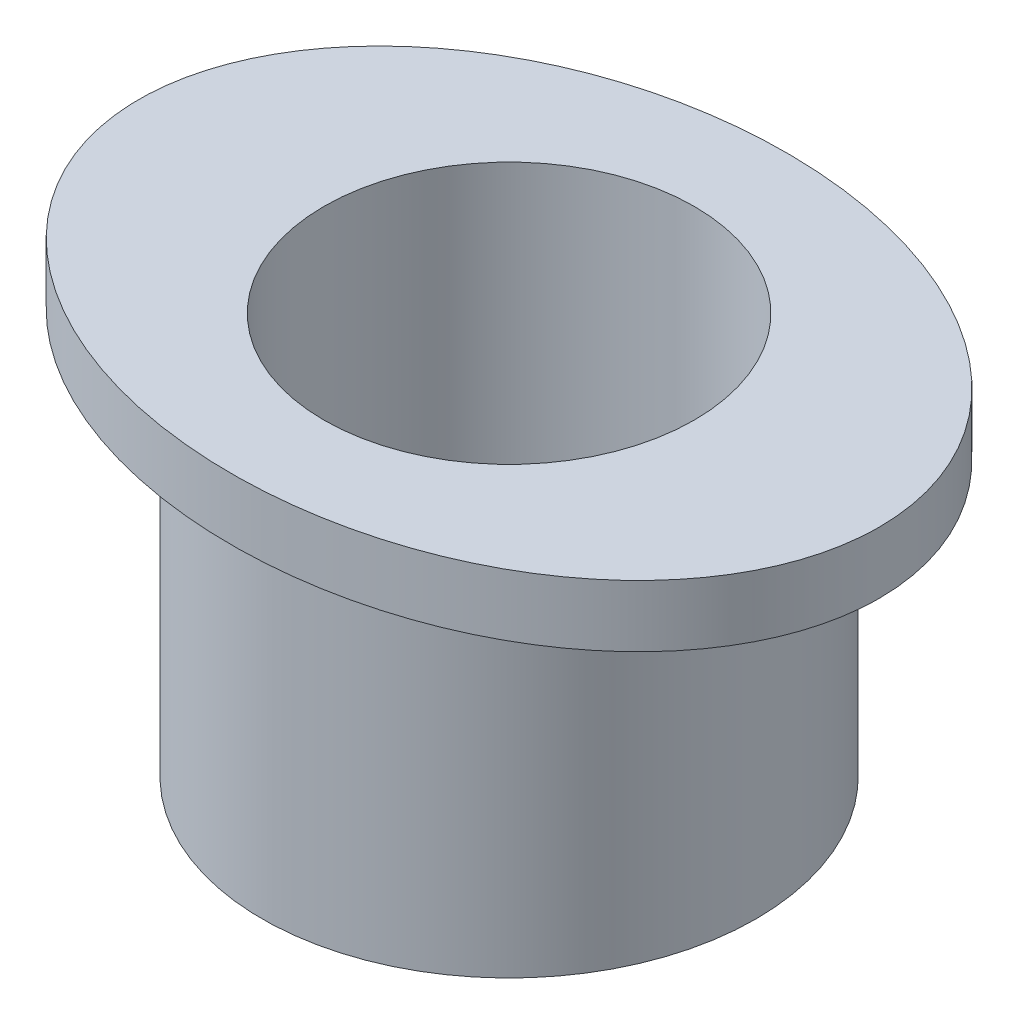
ISO-10303-21;
HEADER;
FILE_DESCRIPTION(('STEP AP214'),'2;1');
FILE_NAME('part.step','',(''),(''),'','','');
FILE_SCHEMA(('AUTOMOTIVE_DESIGN { 1 0 10303 214 1 1 1 1 }'));
ENDSEC;
DATA;
#1=APPLICATION_CONTEXT('core data for automotive mechanical design processes');
#2=APPLICATION_PROTOCOL_DEFINITION('international standard','automotive_design',2000,#1);
#3=PRODUCT_CONTEXT('',#1,'mechanical');
#4=PRODUCT('Part','Part','',(#3));
#5=PRODUCT_RELATED_PRODUCT_CATEGORY('part','',(#4));
#6=PRODUCT_DEFINITION_FORMATION('','',#4);
#7=PRODUCT_DEFINITION_CONTEXT('part definition',#1,'design');
#8=PRODUCT_DEFINITION('design','',#6,#7);
#9=PRODUCT_DEFINITION_SHAPE('','',#8);
#10=(LENGTH_UNIT() NAMED_UNIT(*) SI_UNIT(.MILLI.,.METRE.));
#11=(NAMED_UNIT(*) PLANE_ANGLE_UNIT() SI_UNIT($,.RADIAN.));
#12=(NAMED_UNIT(*) SI_UNIT($,.STERADIAN.) SOLID_ANGLE_UNIT());
#13=UNCERTAINTY_MEASURE_WITH_UNIT(LENGTH_MEASURE(1.E-05),#10,'distance_accuracy_value','');
#14=(GEOMETRIC_REPRESENTATION_CONTEXT(3) GLOBAL_UNCERTAINTY_ASSIGNED_CONTEXT((#13)) GLOBAL_UNIT_ASSIGNED_CONTEXT((#10,
#11,#12)) REPRESENTATION_CONTEXT('',''));
#15=CARTESIAN_POINT('',(0.,0.,0.));
#16=DIRECTION('',(0.,0.,1.));
#17=DIRECTION('',(1.,0.,0.));
#18=AXIS2_PLACEMENT_3D('',#15,#16,#17);
#19=CARTESIAN_POINT('',(0.,-5.5,0.));
#20=DIRECTION('',(0.,1.,0.));
#21=DIRECTION('',(0.,0.,1.));
#22=AXIS2_PLACEMENT_3D('',#19,#20,#21);
#23=CYLINDRICAL_SURFACE('',#22,4.);
#24=CARTESIAN_POINT('',(0.,-5.5,0.));
#25=DIRECTION('',(0.,1.,0.));
#26=DIRECTION('',(1.,0.,0.));
#27=AXIS2_PLACEMENT_3D('',#24,#25,#26);
#28=CIRCLE('',#27,4.);
#29=CARTESIAN_POINT('',(4.,-5.5,0.));
#30=VERTEX_POINT('',#29);
#31=EDGE_CURVE('E11',#30,#30,#28,.T.);
#32=ORIENTED_EDGE('',*,*,#31,.T.);
#33=EDGE_LOOP('',(#32));
#34=FACE_BOUND('',#33,.T.);
#35=CARTESIAN_POINT('',(0.,0.,0.));
#36=DIRECTION('',(0.,1.,0.));
#37=DIRECTION('',(1.,0.,0.));
#38=AXIS2_PLACEMENT_3D('',#35,#36,#37);
#39=CIRCLE('',#38,4.);
#40=CARTESIAN_POINT('',(4.,0.,0.));
#41=VERTEX_POINT('',#40);
#42=EDGE_CURVE('E40',#41,#41,#39,.T.);
#43=ORIENTED_EDGE('',*,*,#42,.F.);
#44=EDGE_LOOP('',(#43));
#45=FACE_BOUND('',#44,.T.);
#46=ADVANCED_FACE('F37',(#34,#45),#23,.T.);
#47=CARTESIAN_POINT('',(0.,-5.5,0.));
#48=DIRECTION('',(0.,1.,0.));
#49=DIRECTION('',(0.,0.,1.));
#50=AXIS2_PLACEMENT_3D('',#47,#48,#49);
#51=PLANE('',#50);
#52=CARTESIAN_POINT('',(0.,-5.5,0.));
#53=DIRECTION('',(0.,1.,0.));
#54=DIRECTION('',(0.,0.,1.));
#55=AXIS2_PLACEMENT_3D('',#52,#53,#54);
#56=CIRCLE('',#55,3.);
#57=CARTESIAN_POINT('',(0.,-5.5,3.));
#58=VERTEX_POINT('',#57);
#59=EDGE_CURVE('E47',#58,#58,#56,.T.);
#60=ORIENTED_EDGE('',*,*,#59,.T.);
#61=EDGE_LOOP('',(#60));
#62=FACE_BOUND('',#61,.T.);
#63=ORIENTED_EDGE('',*,*,#31,.F.);
#64=EDGE_LOOP('',(#63));
#65=FACE_BOUND('',#64,.T.);
#66=ADVANCED_FACE('F70',(#62,#65),#51,.F.);
#67=CARTESIAN_POINT('',(0.,-5.5,0.));
#68=DIRECTION('',(0.,1.,0.));
#69=DIRECTION('',(0.,0.,1.));
#70=AXIS2_PLACEMENT_3D('',#67,#68,#69);
#71=CYLINDRICAL_SURFACE('',#70,3.);
#72=ORIENTED_EDGE('',*,*,#59,.F.);
#73=EDGE_LOOP('',(#72));
#74=FACE_BOUND('',#73,.T.);
#75=CARTESIAN_POINT('',(0.,1.,0.));
#76=DIRECTION('',(0.,1.,0.));
#77=DIRECTION('',(0.,0.,1.));
#78=AXIS2_PLACEMENT_3D('',#75,#76,#77);
#79=CIRCLE('',#78,3.);
#80=CARTESIAN_POINT('',(0.,1.,3.));
#81=VERTEX_POINT('',#80);
#82=EDGE_CURVE('E55',#81,#81,#79,.T.);
#83=ORIENTED_EDGE('',*,*,#82,.T.);
#84=EDGE_LOOP('',(#83));
#85=FACE_BOUND('',#84,.T.);
#86=ADVANCED_FACE('F67',(#74,#85),#71,.F.);
#87=CARTESIAN_POINT('',(0.,1.,0.));
#88=DIRECTION('',(0.,1.,0.));
#89=DIRECTION('',(0.,0.,1.));
#90=AXIS2_PLACEMENT_3D('',#87,#88,#89);
#91=PLANE('',#90);
#92=CARTESIAN_POINT('',(0.,1.,0.));
#93=DIRECTION('',(0.,1.,0.));
#94=DIRECTION('',(1.,0.,0.));
#95=AXIS2_PLACEMENT_3D('',#92,#93,#94);
#96=ELLIPSE('',#95,6.,4.5);
#97=CARTESIAN_POINT('',(6.,1.,0.));
#98=VERTEX_POINT('',#97);
#99=EDGE_CURVE('E51',#98,#98,#96,.T.);
#100=ORIENTED_EDGE('',*,*,#99,.T.);
#101=EDGE_LOOP('',(#100));
#102=FACE_BOUND('',#101,.T.);
#103=ORIENTED_EDGE('',*,*,#82,.F.);
#104=EDGE_LOOP('',(#103));
#105=FACE_BOUND('',#104,.T.);
#106=ADVANCED_FACE('F69',(#102,#105),#91,.T.);
#107=CARTESIAN_POINT('',(0.,0.,0.));
#108=DIRECTION('',(0.,1.,0.));
#109=DIRECTION('',(0.,0.,1.));
#110=AXIS2_PLACEMENT_3D('',#107,#108,#109);
#111=PLANE('',#110);
#112=ORIENTED_EDGE('',*,*,#42,.T.);
#113=EDGE_LOOP('',(#112));
#114=FACE_BOUND('',#113,.T.);
#115=CARTESIAN_POINT('',(0.,0.,0.));
#116=DIRECTION('',(0.,1.,0.));
#117=DIRECTION('',(1.,0.,0.));
#118=AXIS2_PLACEMENT_3D('',#115,#116,#117);
#119=ELLIPSE('',#118,6.,4.5);
#120=CARTESIAN_POINT('',(6.,0.,0.));
#121=VERTEX_POINT('',#120);
#122=EDGE_CURVE('E52',#121,#121,#119,.T.);
#123=ORIENTED_EDGE('',*,*,#122,.F.);
#124=EDGE_LOOP('',(#123));
#125=FACE_BOUND('',#124,.T.);
#126=ADVANCED_FACE('F64',(#114,#125),#111,.F.);
#127=DIRECTION('',(0.,-1.,0.));
#128=VECTOR('',#127,1.);
#129=SURFACE_OF_LINEAR_EXTRUSION('',#96,#128);
#130=ORIENTED_EDGE('',*,*,#99,.F.);
#131=EDGE_LOOP('',(#130));
#132=FACE_BOUND('',#131,.T.);
#133=ORIENTED_EDGE('',*,*,#122,.T.);
#134=EDGE_LOOP('',(#133));
#135=FACE_BOUND('',#134,.T.);
#136=ADVANCED_FACE('F60',(#132,#135),#129,.F.);
#137=CLOSED_SHELL('',(#46,#66,#86,#106,#126,#136));
#138=MANIFOLD_SOLID_BREP('B2',#137);
#139=ADVANCED_BREP_SHAPE_REPRESENTATION('',(#18,#138),#14);
#140=SHAPE_DEFINITION_REPRESENTATION(#9,#139);
ENDSEC;
END-ISO-10303-21;
